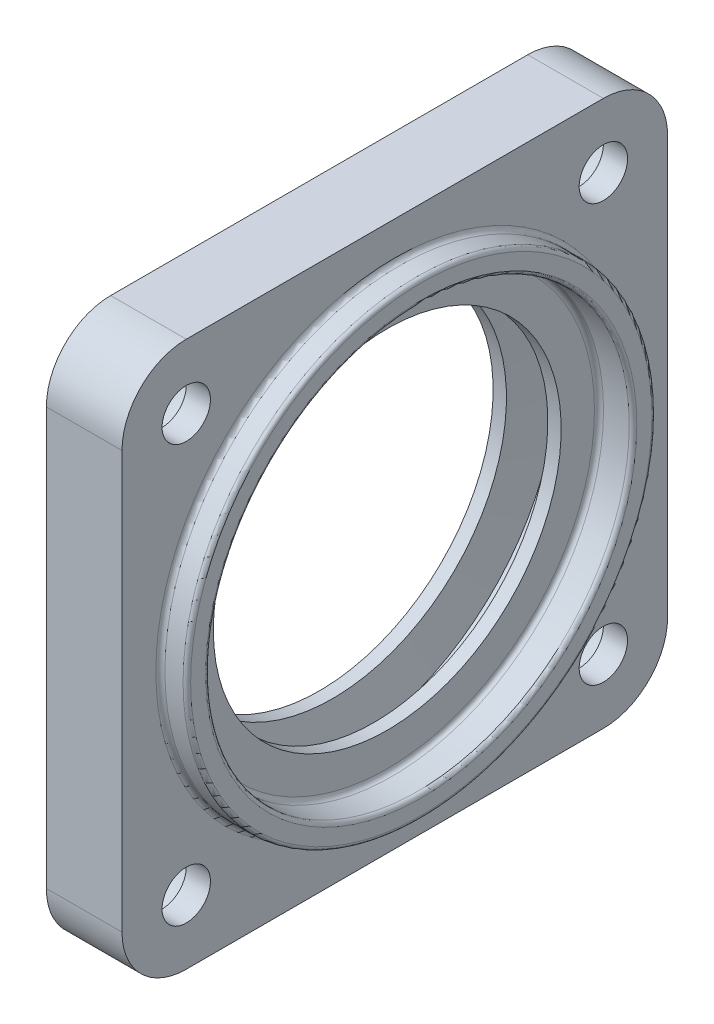
ISO-10303-21;
HEADER;
FILE_DESCRIPTION(('STEP AP214'),'2;1');
FILE_NAME('part.step','',(''),(''),'','','');
FILE_SCHEMA(('AUTOMOTIVE_DESIGN { 1 0 10303 214 1 1 1 1 }'));
ENDSEC;
DATA;
#1=APPLICATION_CONTEXT('core data for automotive mechanical design processes');
#2=APPLICATION_PROTOCOL_DEFINITION('international standard','automotive_design',2000,#1);
#3=PRODUCT_CONTEXT('',#1,'mechanical');
#4=PRODUCT('Part','Part','',(#3));
#5=PRODUCT_RELATED_PRODUCT_CATEGORY('part','',(#4));
#6=PRODUCT_DEFINITION_FORMATION('','',#4);
#7=PRODUCT_DEFINITION_CONTEXT('part definition',#1,'design');
#8=PRODUCT_DEFINITION('design','',#6,#7);
#9=PRODUCT_DEFINITION_SHAPE('','',#8);
#10=(LENGTH_UNIT() NAMED_UNIT(*) SI_UNIT(.MILLI.,.METRE.));
#11=(NAMED_UNIT(*) PLANE_ANGLE_UNIT() SI_UNIT($,.RADIAN.));
#12=(NAMED_UNIT(*) SI_UNIT($,.STERADIAN.) SOLID_ANGLE_UNIT());
#13=UNCERTAINTY_MEASURE_WITH_UNIT(LENGTH_MEASURE(1.E-05),#10,'distance_accuracy_value','');
#14=(GEOMETRIC_REPRESENTATION_CONTEXT(3) GLOBAL_UNCERTAINTY_ASSIGNED_CONTEXT((#13)) GLOBAL_UNIT_ASSIGNED_CONTEXT((#10,
#11,#12)) REPRESENTATION_CONTEXT('',''));
#15=CARTESIAN_POINT('',(0.,0.,0.));
#16=DIRECTION('',(0.,0.,1.));
#17=DIRECTION('',(1.,0.,0.));
#18=AXIS2_PLACEMENT_3D('',#15,#16,#17);
#19=CARTESIAN_POINT('',(0.,0.,0.));
#20=DIRECTION('',(-1.,0.,0.));
#21=DIRECTION('',(0.,0.,1.));
#22=AXIS2_PLACEMENT_3D('',#19,#20,#21);
#23=CYLINDRICAL_SURFACE('',#22,28.);
#24=CARTESIAN_POINT('',(5.09999999999999,0.,0.));
#25=DIRECTION('',(-1.,0.,0.));
#26=DIRECTION('',(0.,0.,1.));
#27=AXIS2_PLACEMENT_3D('',#24,#25,#26);
#28=CIRCLE('',#27,28.);
#29=CARTESIAN_POINT('',(5.09999999999999,0.,28.0000000000001));
#30=VERTEX_POINT('',#29);
#31=EDGE_CURVE('E41',#30,#30,#28,.T.);
#32=ORIENTED_EDGE('',*,*,#31,.T.);
#33=EDGE_LOOP('',(#32));
#34=FACE_BOUND('',#33,.T.);
#35=CARTESIAN_POINT('',(8.50000000000001,0.,0.));
#36=DIRECTION('',(1.,0.,0.));
#37=DIRECTION('',(0.,0.,-1.));
#38=AXIS2_PLACEMENT_3D('',#35,#36,#37);
#39=CIRCLE('',#38,28.);
#40=CARTESIAN_POINT('',(8.50000000000001,0.,-28.0000000000001));
#41=VERTEX_POINT('',#40);
#42=EDGE_CURVE('E239',#41,#41,#39,.T.);
#43=ORIENTED_EDGE('',*,*,#42,.T.);
#44=EDGE_LOOP('',(#43));
#45=FACE_BOUND('',#44,.T.);
#46=ADVANCED_FACE('F33',(#34,#45),#23,.F.);
#47=CARTESIAN_POINT('',(0.,0.,0.));
#48=DIRECTION('',(-1.,0.,0.));
#49=DIRECTION('',(0.,0.,1.));
#50=AXIS2_PLACEMENT_3D('',#47,#48,#49);
#51=CYLINDRICAL_SURFACE('',#50,31.);
#52=CARTESIAN_POINT('',(8.50000000000001,0.,0.));
#53=DIRECTION('',(1.,0.,0.));
#54=DIRECTION('',(0.,0.,-1.));
#55=AXIS2_PLACEMENT_3D('',#52,#53,#54);
#56=CIRCLE('',#55,31.);
#57=CARTESIAN_POINT('',(8.50000000000001,0.,-31.0000000000002));
#58=VERTEX_POINT('',#57);
#59=EDGE_CURVE('E242',#58,#58,#56,.F.);
#60=ORIENTED_EDGE('',*,*,#59,.T.);
#61=EDGE_LOOP('',(#60));
#62=FACE_BOUND('',#61,.T.);
#63=CARTESIAN_POINT('',(6.09999999999999,0.,0.));
#64=DIRECTION('',(-1.,0.,0.));
#65=DIRECTION('',(0.,0.,1.));
#66=AXIS2_PLACEMENT_3D('',#63,#64,#65);
#67=CIRCLE('',#66,31.);
#68=CARTESIAN_POINT('',(6.09999999999999,0.,31.0000000000002));
#69=VERTEX_POINT('',#68);
#70=EDGE_CURVE('E230',#69,#69,#67,.F.);
#71=ORIENTED_EDGE('',*,*,#70,.T.);
#72=EDGE_LOOP('',(#71));
#73=FACE_BOUND('',#72,.T.);
#74=ADVANCED_FACE('F259',(#62,#73),#51,.T.);
#75=CARTESIAN_POINT('',(-4.5,47.5000000000003,0.));
#76=DIRECTION('',(1.,0.,0.));
#77=DIRECTION('',(0.,0.,-1.));
#78=AXIS2_PLACEMENT_3D('',#75,#76,#77);
#79=PLANE('',#78);
#80=CARTESIAN_POINT('',(-4.5,27.5771644662755,-27.5771644662755));
#81=DIRECTION('',(-1.,0.,0.));
#82=DIRECTION('',(0.,0.,1.));
#83=AXIS2_PLACEMENT_3D('',#80,#81,#82);
#84=CIRCLE('',#83,5.49999999999999);
#85=CARTESIAN_POINT('',(-4.5,27.5771644662755,-22.0771644662755));
#86=VERTEX_POINT('',#85);
#87=EDGE_CURVE('E153',#86,#86,#84,.T.);
#88=ORIENTED_EDGE('',*,*,#87,.F.);
#89=EDGE_LOOP('',(#88));
#90=FACE_BOUND('',#89,.T.);
#91=CARTESIAN_POINT('',(-4.5,27.5771644662755,27.5771644662755));
#92=DIRECTION('',(-1.,0.,0.));
#93=DIRECTION('',(0.,0.,1.));
#94=AXIS2_PLACEMENT_3D('',#91,#92,#93);
#95=CIRCLE('',#94,5.49999999999999);
#96=CARTESIAN_POINT('',(-4.5,27.5771644662755,33.0771644662755));
#97=VERTEX_POINT('',#96);
#98=EDGE_CURVE('E163',#97,#97,#95,.T.);
#99=ORIENTED_EDGE('',*,*,#98,.F.);
#100=EDGE_LOOP('',(#99));
#101=FACE_BOUND('',#100,.T.);
#102=CARTESIAN_POINT('',(-4.5,-27.5771644662755,27.5771644662755));
#103=DIRECTION('',(-1.,0.,0.));
#104=DIRECTION('',(0.,0.,1.));
#105=AXIS2_PLACEMENT_3D('',#102,#103,#104);
#106=CIRCLE('',#105,5.49999999999999);
#107=CARTESIAN_POINT('',(-4.5,-27.5771644662755,33.0771644662755));
#108=VERTEX_POINT('',#107);
#109=EDGE_CURVE('E173',#108,#108,#106,.T.);
#110=ORIENTED_EDGE('',*,*,#109,.F.);
#111=EDGE_LOOP('',(#110));
#112=FACE_BOUND('',#111,.T.);
#113=CARTESIAN_POINT('',(-4.5,-27.5771644662755,-27.5771644662755));
#114=DIRECTION('',(-1.,0.,0.));
#115=DIRECTION('',(0.,0.,1.));
#116=AXIS2_PLACEMENT_3D('',#113,#114,#115);
#117=CIRCLE('',#116,5.49999999999999);
#118=CARTESIAN_POINT('',(-4.5,-27.5771644662755,-22.0771644662755));
#119=VERTEX_POINT('',#118);
#120=EDGE_CURVE('E183',#119,#119,#117,.T.);
#121=ORIENTED_EDGE('',*,*,#120,.F.);
#122=EDGE_LOOP('',(#121));
#123=FACE_BOUND('',#122,.T.);
#124=CARTESIAN_POINT('',(-4.5,0.,0.));
#125=DIRECTION('',(-1.,0.,0.));
#126=DIRECTION('',(0.,0.,1.));
#127=AXIS2_PLACEMENT_3D('',#124,#125,#126);
#128=CIRCLE('',#127,23.);
#129=CARTESIAN_POINT('',(-4.5,0.,23.0000000000001));
#130=VERTEX_POINT('',#129);
#131=EDGE_CURVE('E208',#130,#130,#128,.T.);
#132=ORIENTED_EDGE('',*,*,#131,.F.);
#133=EDGE_LOOP('',(#132));
#134=FACE_BOUND('',#133,.T.);
#135=CARTESIAN_POINT('',(-4.5,27.5771644662755,-27.5771644662755));
#136=DIRECTION('',(-1.,0.,0.));
#137=DIRECTION('',(0.,0.,1.));
#138=AXIS2_PLACEMENT_3D('',#135,#136,#137);
#139=CIRCLE('',#138,8.5);
#140=CARTESIAN_POINT('',(-4.5,36.0771644662755,-27.5771644662755));
#141=VERTEX_POINT('',#140);
#142=CARTESIAN_POINT('',(-4.5,27.5771644662757,-36.0771644662755));
#143=VERTEX_POINT('',#142);
#144=EDGE_CURVE('E414',#141,#143,#139,.T.);
#145=ORIENTED_EDGE('',*,*,#144,.T.);
#146=DIRECTION('',(0.,-1.,0.));
#147=VECTOR('',#146,1.);
#148=CARTESIAN_POINT('',(-4.5,27.5771644662757,-36.0771644662755));
#149=LINE('',#148,#147);
#150=CARTESIAN_POINT('',(-4.5,-27.5771644662755,-36.0771644662755));
#151=VERTEX_POINT('',#150);
#152=EDGE_CURVE('E105',#143,#151,#149,.T.);
#153=ORIENTED_EDGE('',*,*,#152,.T.);
#154=CARTESIAN_POINT('',(-4.5,-27.5771644662755,-27.5771644662755));
#155=DIRECTION('',(-1.,0.,0.));
#156=DIRECTION('',(0.,0.,1.));
#157=AXIS2_PLACEMENT_3D('',#154,#155,#156);
#158=CIRCLE('',#157,8.5);
#159=CARTESIAN_POINT('',(-4.5,-36.0771644662755,-27.5771644662755));
#160=VERTEX_POINT('',#159);
#161=EDGE_CURVE('E48',#151,#160,#158,.T.);
#162=ORIENTED_EDGE('',*,*,#161,.T.);
#163=DIRECTION('',(0.,0.,1.));
#164=VECTOR('',#163,1.);
#165=CARTESIAN_POINT('',(-4.5,-36.0771644662755,-27.5771644662755));
#166=LINE('',#165,#164);
#167=CARTESIAN_POINT('',(-4.5,-36.0771644662755,27.5771644662755));
#168=VERTEX_POINT('',#167);
#169=EDGE_CURVE('E103',#160,#168,#166,.T.);
#170=ORIENTED_EDGE('',*,*,#169,.T.);
#171=CARTESIAN_POINT('',(-4.5,-27.5771644662755,27.5771644662755));
#172=DIRECTION('',(-1.,0.,0.));
#173=DIRECTION('',(0.,0.,1.));
#174=AXIS2_PLACEMENT_3D('',#171,#172,#173);
#175=CIRCLE('',#174,8.5);
#176=CARTESIAN_POINT('',(-4.5,-27.5771644662755,36.0771644662755));
#177=VERTEX_POINT('',#176);
#178=EDGE_CURVE('E120',#168,#177,#175,.T.);
#179=ORIENTED_EDGE('',*,*,#178,.T.);
#180=DIRECTION('',(0.,1.,0.));
#181=VECTOR('',#180,1.);
#182=CARTESIAN_POINT('',(-4.5,-27.5771644662755,36.0771644662755));
#183=LINE('',#182,#181);
#184=CARTESIAN_POINT('',(-4.5,27.5771644662755,36.0771644662755));
#185=VERTEX_POINT('',#184);
#186=EDGE_CURVE('E122',#177,#185,#183,.T.);
#187=ORIENTED_EDGE('',*,*,#186,.T.);
#188=CARTESIAN_POINT('',(-4.5,27.5771644662755,27.5771644662755));
#189=DIRECTION('',(-1.,0.,0.));
#190=DIRECTION('',(0.,0.,1.));
#191=AXIS2_PLACEMENT_3D('',#188,#189,#190);
#192=CIRCLE('',#191,8.5);
#193=CARTESIAN_POINT('',(-4.5,36.0771644662755,27.5771644662755));
#194=VERTEX_POINT('',#193);
#195=EDGE_CURVE('E128',#185,#194,#192,.T.);
#196=ORIENTED_EDGE('',*,*,#195,.T.);
#197=DIRECTION('',(0.,0.,-1.));
#198=VECTOR('',#197,1.);
#199=CARTESIAN_POINT('',(-4.5,36.0771644662755,27.5771644662755));
#200=LINE('',#199,#198);
#201=EDGE_CURVE('E130',#194,#141,#200,.T.);
#202=ORIENTED_EDGE('',*,*,#201,.T.);
#203=EDGE_LOOP('',(#145,#153,#162,#170,#179,#187,#196,#202));
#204=FACE_BOUND('',#203,.T.);
#205=ADVANCED_FACE('F101',(#90,#101,#112,#123,#134,#204),#79,.F.);
#206=CARTESIAN_POINT('',(5.50000000000001,31.0000000000002,0.));
#207=DIRECTION('',(-1.,0.,0.));
#208=DIRECTION('',(0.,0.,1.));
#209=AXIS2_PLACEMENT_3D('',#206,#207,#208);
#210=PLANE('',#209);
#211=CARTESIAN_POINT('',(5.50000000000001,0.,0.));
#212=DIRECTION('',(-1.,0.,0.));
#213=DIRECTION('',(0.,0.,1.));
#214=AXIS2_PLACEMENT_3D('',#211,#212,#213);
#215=CIRCLE('',#214,31.6);
#216=CARTESIAN_POINT('',(5.50000000000001,0.,31.6000000000002));
#217=VERTEX_POINT('',#216);
#218=EDGE_CURVE('E227',#217,#217,#215,.T.);
#219=ORIENTED_EDGE('',*,*,#218,.T.);
#220=EDGE_LOOP('',(#219));
#221=FACE_BOUND('',#220,.T.);
#222=CARTESIAN_POINT('',(5.50000000000001,27.5771644662755,-27.5771644662755));
#223=DIRECTION('',(-1.,0.,0.));
#224=DIRECTION('',(0.,0.,1.));
#225=AXIS2_PLACEMENT_3D('',#222,#223,#224);
#226=CIRCLE('',#225,3.2);
#227=CARTESIAN_POINT('',(5.50000000000001,27.5771644662755,-24.3771644662755));
#228=VERTEX_POINT('',#227);
#229=EDGE_CURVE('E162',#228,#228,#226,.T.);
#230=ORIENTED_EDGE('',*,*,#229,.T.);
#231=EDGE_LOOP('',(#230));
#232=FACE_BOUND('',#231,.T.);
#233=CARTESIAN_POINT('',(5.50000000000001,27.5771644662755,27.5771644662755));
#234=DIRECTION('',(-1.,0.,0.));
#235=DIRECTION('',(0.,0.,1.));
#236=AXIS2_PLACEMENT_3D('',#233,#234,#235);
#237=CIRCLE('',#236,3.2);
#238=CARTESIAN_POINT('',(5.50000000000001,27.5771644662755,30.7771644662755));
#239=VERTEX_POINT('',#238);
#240=EDGE_CURVE('E172',#239,#239,#237,.T.);
#241=ORIENTED_EDGE('',*,*,#240,.T.);
#242=EDGE_LOOP('',(#241));
#243=FACE_BOUND('',#242,.T.);
#244=CARTESIAN_POINT('',(5.50000000000001,-27.5771644662755,27.5771644662755));
#245=DIRECTION('',(-1.,0.,0.));
#246=DIRECTION('',(0.,0.,1.));
#247=AXIS2_PLACEMENT_3D('',#244,#245,#246);
#248=CIRCLE('',#247,3.2);
#249=CARTESIAN_POINT('',(5.50000000000001,-27.5771644662755,30.7771644662755));
#250=VERTEX_POINT('',#249);
#251=EDGE_CURVE('E182',#250,#250,#248,.T.);
#252=ORIENTED_EDGE('',*,*,#251,.T.);
#253=EDGE_LOOP('',(#252));
#254=FACE_BOUND('',#253,.T.);
#255=CARTESIAN_POINT('',(5.50000000000001,-27.5771644662755,-27.5771644662755));
#256=DIRECTION('',(-1.,0.,0.));
#257=DIRECTION('',(0.,0.,1.));
#258=AXIS2_PLACEMENT_3D('',#255,#256,#257);
#259=CIRCLE('',#258,3.2);
#260=CARTESIAN_POINT('',(5.50000000000001,-27.5771644662755,-24.3771644662755));
#261=VERTEX_POINT('',#260);
#262=EDGE_CURVE('E192',#261,#261,#259,.T.);
#263=ORIENTED_EDGE('',*,*,#262,.T.);
#264=EDGE_LOOP('',(#263));
#265=FACE_BOUND('',#264,.T.);
#266=CARTESIAN_POINT('',(5.50000000000001,27.5771644662755,27.5771644662755));
#267=DIRECTION('',(-1.,0.,0.));
#268=DIRECTION('',(0.,0.,1.));
#269=AXIS2_PLACEMENT_3D('',#266,#267,#268);
#270=CIRCLE('',#269,8.5);
#271=CARTESIAN_POINT('',(5.50000000000001,27.5771644662755,36.0771644662755));
#272=VERTEX_POINT('',#271);
#273=CARTESIAN_POINT('',(5.50000000000001,36.0771644662755,27.5771644662755));
#274=VERTEX_POINT('',#273);
#275=EDGE_CURVE('E150',#272,#274,#270,.T.);
#276=ORIENTED_EDGE('',*,*,#275,.F.);
#277=DIRECTION('',(0.,1.,0.));
#278=VECTOR('',#277,1.);
#279=CARTESIAN_POINT('',(5.50000000000001,31.0000000000002,36.0771644662755));
#280=LINE('',#279,#278);
#281=CARTESIAN_POINT('',(5.50000000000001,-27.5771644662755,36.0771644662755));
#282=VERTEX_POINT('',#281);
#283=EDGE_CURVE('E225',#282,#272,#280,.T.);
#284=ORIENTED_EDGE('',*,*,#283,.F.);
#285=CARTESIAN_POINT('',(5.50000000000001,-27.5771644662755,27.5771644662755));
#286=DIRECTION('',(-1.,0.,0.));
#287=DIRECTION('',(0.,0.,1.));
#288=AXIS2_PLACEMENT_3D('',#285,#286,#287);
#289=CIRCLE('',#288,8.5);
#290=CARTESIAN_POINT('',(5.50000000000001,-36.0771644662755,27.5771644662755));
#291=VERTEX_POINT('',#290);
#292=EDGE_CURVE('E148',#291,#282,#289,.T.);
#293=ORIENTED_EDGE('',*,*,#292,.F.);
#294=DIRECTION('',(0.,0.,1.));
#295=VECTOR('',#294,1.);
#296=CARTESIAN_POINT('',(5.50000000000001,-36.0771644662755,0.));
#297=LINE('',#296,#295);
#298=CARTESIAN_POINT('',(5.50000000000001,-36.0771644662755,-27.5771644662755));
#299=VERTEX_POINT('',#298);
#300=EDGE_CURVE('E221',#299,#291,#297,.T.);
#301=ORIENTED_EDGE('',*,*,#300,.F.);
#302=CARTESIAN_POINT('',(5.50000000000001,-27.5771644662755,-27.5771644662755));
#303=DIRECTION('',(-1.,0.,0.));
#304=DIRECTION('',(0.,0.,1.));
#305=AXIS2_PLACEMENT_3D('',#302,#303,#304);
#306=CIRCLE('',#305,8.5);
#307=CARTESIAN_POINT('',(5.50000000000001,-27.5771644662755,-36.0771644662755));
#308=VERTEX_POINT('',#307);
#309=EDGE_CURVE('E111',#308,#299,#306,.T.);
#310=ORIENTED_EDGE('',*,*,#309,.F.);
#311=DIRECTION('',(0.,-1.,0.));
#312=VECTOR('',#311,1.);
#313=CARTESIAN_POINT('',(5.50000000000001,31.0000000000003,-36.0771644662755));
#314=LINE('',#313,#312);
#315=CARTESIAN_POINT('',(5.50000000000001,27.5771644662757,-36.0771644662755));
#316=VERTEX_POINT('',#315);
#317=EDGE_CURVE('E211',#316,#308,#314,.T.);
#318=ORIENTED_EDGE('',*,*,#317,.F.);
#319=CARTESIAN_POINT('',(5.50000000000001,27.5771644662755,-27.5771644662755));
#320=DIRECTION('',(-1.,0.,0.));
#321=DIRECTION('',(0.,0.,1.));
#322=AXIS2_PLACEMENT_3D('',#319,#320,#321);
#323=CIRCLE('',#322,8.5);
#324=CARTESIAN_POINT('',(5.50000000000001,36.0771644662755,-27.5771644662755));
#325=VERTEX_POINT('',#324);
#326=EDGE_CURVE('E56',#325,#316,#323,.T.);
#327=ORIENTED_EDGE('',*,*,#326,.F.);
#328=DIRECTION('',(0.,0.,-1.));
#329=VECTOR('',#328,1.);
#330=CARTESIAN_POINT('',(5.50000000000001,36.0771644662755,0.));
#331=LINE('',#330,#329);
#332=EDGE_CURVE('E223',#274,#325,#331,.T.);
#333=ORIENTED_EDGE('',*,*,#332,.F.);
#334=EDGE_LOOP('',(#276,#284,#293,#301,#310,#318,#327,#333));
#335=FACE_BOUND('',#334,.T.);
#336=ADVANCED_FACE('F292',(#221,#232,#243,#254,#265,#335),#210,.F.);
#337=CARTESIAN_POINT('',(0.,0.,0.));
#338=DIRECTION('',(-1.,0.,0.));
#339=DIRECTION('',(0.,0.,1.));
#340=AXIS2_PLACEMENT_3D('',#337,#338,#339);
#341=CYLINDRICAL_SURFACE('',#340,23.);
#342=CARTESIAN_POINT('',(-2.7367073654174,0.,0.));
#343=DIRECTION('',(-1.,0.,0.));
#344=DIRECTION('',(0.,0.,1.));
#345=AXIS2_PLACEMENT_3D('',#342,#343,#344);
#346=CIRCLE('',#345,23.);
#347=CARTESIAN_POINT('',(-2.7367073654174,0.,23.0000000000001));
#348=VERTEX_POINT('',#347);
#349=EDGE_CURVE('E205',#348,#348,#346,.T.);
#350=ORIENTED_EDGE('',*,*,#349,.F.);
#351=EDGE_LOOP('',(#350));
#352=FACE_BOUND('',#351,.T.);
#353=ORIENTED_EDGE('',*,*,#131,.T.);
#354=EDGE_LOOP('',(#353));
#355=FACE_BOUND('',#354,.T.);
#356=ADVANCED_FACE('F288',(#352,#355),#341,.F.);
#357=CARTESIAN_POINT('',(-2.7367073654174,0.,0.));
#358=DIRECTION('',(1.,0.,0.));
#359=DIRECTION('',(0.,0.,-1.));
#360=AXIS2_PLACEMENT_3D('',#357,#358,#359);
#361=CONICAL_SURFACE('',#360,23.,1.4486232791553);
#362=CARTESIAN_POINT('',(-2.,0.,0.));
#363=DIRECTION('',(-1.,0.,0.));
#364=DIRECTION('',(0.,0.,1.));
#365=AXIS2_PLACEMENT_3D('',#362,#363,#364);
#366=CIRCLE('',#365,29.);
#367=CARTESIAN_POINT('',(-2.,0.,29.0000000000001));
#368=VERTEX_POINT('',#367);
#369=EDGE_CURVE('E202',#368,#368,#366,.T.);
#370=ORIENTED_EDGE('',*,*,#369,.F.);
#371=EDGE_LOOP('',(#370));
#372=FACE_BOUND('',#371,.T.);
#373=ORIENTED_EDGE('',*,*,#349,.T.);
#374=EDGE_LOOP('',(#373));
#375=FACE_BOUND('',#374,.T.);
#376=ADVANCED_FACE('F284',(#372,#375),#361,.F.);
#377=CARTESIAN_POINT('',(0.,0.,0.));
#378=DIRECTION('',(-1.,0.,0.));
#379=DIRECTION('',(0.,0.,1.));
#380=AXIS2_PLACEMENT_3D('',#377,#378,#379);
#381=CYLINDRICAL_SURFACE('',#380,29.);
#382=CARTESIAN_POINT('',(2.,0.,0.));
#383=DIRECTION('',(-1.,0.,0.));
#384=DIRECTION('',(0.,0.,1.));
#385=AXIS2_PLACEMENT_3D('',#382,#383,#384);
#386=CIRCLE('',#385,29.);
#387=CARTESIAN_POINT('',(2.,0.,29.0000000000001));
#388=VERTEX_POINT('',#387);
#389=EDGE_CURVE('E199',#388,#388,#386,.T.);
#390=ORIENTED_EDGE('',*,*,#389,.F.);
#391=EDGE_LOOP('',(#390));
#392=FACE_BOUND('',#391,.T.);
#393=ORIENTED_EDGE('',*,*,#369,.T.);
#394=EDGE_LOOP('',(#393));
#395=FACE_BOUND('',#394,.T.);
#396=ADVANCED_FACE('F280',(#392,#395),#381,.F.);
#397=CARTESIAN_POINT('',(2.,0.,0.));
#398=DIRECTION('',(-1.,0.,0.));
#399=DIRECTION('',(0.,0.,1.));
#400=AXIS2_PLACEMENT_3D('',#397,#398,#399);
#401=CONICAL_SURFACE('',#400,29.,1.4486232791553);
#402=CARTESIAN_POINT('',(2.7367073654174,0.,0.));
#403=DIRECTION('',(-1.,0.,0.));
#404=DIRECTION('',(0.,0.,1.));
#405=AXIS2_PLACEMENT_3D('',#402,#403,#404);
#406=CIRCLE('',#405,23.);
#407=CARTESIAN_POINT('',(2.7367073654174,0.,23.0000000000001));
#408=VERTEX_POINT('',#407);
#409=EDGE_CURVE('E196',#408,#408,#406,.T.);
#410=ORIENTED_EDGE('',*,*,#409,.F.);
#411=EDGE_LOOP('',(#410));
#412=FACE_BOUND('',#411,.T.);
#413=ORIENTED_EDGE('',*,*,#389,.T.);
#414=EDGE_LOOP('',(#413));
#415=FACE_BOUND('',#414,.T.);
#416=ADVANCED_FACE('F276',(#412,#415),#401,.F.);
#417=CARTESIAN_POINT('',(0.,0.,0.));
#418=DIRECTION('',(-1.,0.,0.));
#419=DIRECTION('',(0.,0.,1.));
#420=AXIS2_PLACEMENT_3D('',#417,#418,#419);
#421=CYLINDRICAL_SURFACE('',#420,23.);
#422=CARTESIAN_POINT('',(4.5,0.,0.));
#423=DIRECTION('',(-1.,0.,0.));
#424=DIRECTION('',(0.,0.,1.));
#425=AXIS2_PLACEMENT_3D('',#422,#423,#424);
#426=CIRCLE('',#425,23.);
#427=CARTESIAN_POINT('',(4.5,0.,23.0000000000001));
#428=VERTEX_POINT('',#427);
#429=EDGE_CURVE('E193',#428,#428,#426,.T.);
#430=ORIENTED_EDGE('',*,*,#429,.F.);
#431=EDGE_LOOP('',(#430));
#432=FACE_BOUND('',#431,.T.);
#433=ORIENTED_EDGE('',*,*,#409,.T.);
#434=EDGE_LOOP('',(#433));
#435=FACE_BOUND('',#434,.T.);
#436=ADVANCED_FACE('F272',(#432,#435),#421,.F.);
#437=CARTESIAN_POINT('',(4.5,23.0000000000002,0.));
#438=DIRECTION('',(-1.,0.,0.));
#439=DIRECTION('',(0.,0.,1.));
#440=AXIS2_PLACEMENT_3D('',#437,#438,#439);
#441=PLANE('',#440);
#442=CARTESIAN_POINT('',(4.5,0.,0.));
#443=DIRECTION('',(-1.,0.,0.));
#444=DIRECTION('',(0.,0.,1.));
#445=AXIS2_PLACEMENT_3D('',#442,#443,#444);
#446=CIRCLE('',#445,27.4);
#447=CARTESIAN_POINT('',(4.5,0.,27.4000000000001));
#448=VERTEX_POINT('',#447);
#449=EDGE_CURVE('E12',#448,#448,#446,.F.);
#450=ORIENTED_EDGE('',*,*,#449,.T.);
#451=EDGE_LOOP('',(#450));
#452=FACE_BOUND('',#451,.T.);
#453=ORIENTED_EDGE('',*,*,#429,.T.);
#454=EDGE_LOOP('',(#453));
#455=FACE_BOUND('',#454,.T.);
#456=ADVANCED_FACE('F268',(#452,#455),#441,.F.);
#457=CARTESIAN_POINT('',(-4.5,-27.5771644662755,-27.5771644662755));
#458=DIRECTION('',(-1.,0.,0.));
#459=DIRECTION('',(0.,0.,1.));
#460=AXIS2_PLACEMENT_3D('',#457,#458,#459);
#461=CYLINDRICAL_SURFACE('',#460,3.2);
#462=CARTESIAN_POINT('',(2.3,-27.5771644662755,-27.5771644662755));
#463=DIRECTION('',(-1.,0.,0.));
#464=DIRECTION('',(0.,0.,1.));
#465=AXIS2_PLACEMENT_3D('',#462,#463,#464);
#466=CIRCLE('',#465,3.2);
#467=CARTESIAN_POINT('',(2.3,-27.5771644662755,-24.3771644662755));
#468=VERTEX_POINT('',#467);
#469=EDGE_CURVE('E189',#468,#468,#466,.T.);
#470=ORIENTED_EDGE('',*,*,#469,.T.);
#471=EDGE_LOOP('',(#470));
#472=FACE_BOUND('',#471,.T.);
#473=ORIENTED_EDGE('',*,*,#262,.F.);
#474=EDGE_LOOP('',(#473));
#475=FACE_BOUND('',#474,.T.);
#476=ADVANCED_FACE('F271',(#472,#475),#461,.F.);
#477=CARTESIAN_POINT('',(2.3,-24.3771644662755,-27.5771644662755));
#478=DIRECTION('',(1.,0.,0.));
#479=DIRECTION('',(0.,0.,-1.));
#480=AXIS2_PLACEMENT_3D('',#477,#478,#479);
#481=PLANE('',#480);
#482=ORIENTED_EDGE('',*,*,#469,.F.);
#483=EDGE_LOOP('',(#482));
#484=FACE_BOUND('',#483,.T.);
#485=CARTESIAN_POINT('',(2.3,-27.5771644662755,-27.5771644662755));
#486=DIRECTION('',(-1.,0.,0.));
#487=DIRECTION('',(0.,0.,1.));
#488=AXIS2_PLACEMENT_3D('',#485,#486,#487);
#489=CIRCLE('',#488,5.5);
#490=CARTESIAN_POINT('',(2.3,-27.5771644662755,-22.0771644662755));
#491=VERTEX_POINT('',#490);
#492=EDGE_CURVE('E186',#491,#491,#489,.T.);
#493=ORIENTED_EDGE('',*,*,#492,.T.);
#494=EDGE_LOOP('',(#493));
#495=FACE_BOUND('',#494,.T.);
#496=ADVANCED_FACE('F384',(#484,#495),#481,.F.);
#497=CARTESIAN_POINT('',(-4.5,-27.5771644662755,-27.5771644662755));
#498=DIRECTION('',(-1.,0.,0.));
#499=DIRECTION('',(0.,0.,1.));
#500=AXIS2_PLACEMENT_3D('',#497,#498,#499);
#501=CYLINDRICAL_SURFACE('',#500,5.5);
#502=ORIENTED_EDGE('',*,*,#492,.F.);
#503=EDGE_LOOP('',(#502));
#504=FACE_BOUND('',#503,.T.);
#505=ORIENTED_EDGE('',*,*,#120,.T.);
#506=EDGE_LOOP('',(#505));
#507=FACE_BOUND('',#506,.T.);
#508=ADVANCED_FACE('F380',(#504,#507),#501,.F.);
#509=CARTESIAN_POINT('',(-4.5,-27.5771644662755,27.5771644662755));
#510=DIRECTION('',(-1.,0.,0.));
#511=DIRECTION('',(0.,0.,1.));
#512=AXIS2_PLACEMENT_3D('',#509,#510,#511);
#513=CYLINDRICAL_SURFACE('',#512,3.2);
#514=CARTESIAN_POINT('',(2.3,-27.5771644662755,27.5771644662755));
#515=DIRECTION('',(-1.,0.,0.));
#516=DIRECTION('',(0.,0.,1.));
#517=AXIS2_PLACEMENT_3D('',#514,#515,#516);
#518=CIRCLE('',#517,3.2);
#519=CARTESIAN_POINT('',(2.3,-27.5771644662755,30.7771644662755));
#520=VERTEX_POINT('',#519);
#521=EDGE_CURVE('E179',#520,#520,#518,.T.);
#522=ORIENTED_EDGE('',*,*,#521,.T.);
#523=EDGE_LOOP('',(#522));
#524=FACE_BOUND('',#523,.T.);
#525=ORIENTED_EDGE('',*,*,#251,.F.);
#526=EDGE_LOOP('',(#525));
#527=FACE_BOUND('',#526,.T.);
#528=ADVANCED_FACE('F376',(#524,#527),#513,.F.);
#529=CARTESIAN_POINT('',(2.3,-24.3771644662755,27.5771644662755));
#530=DIRECTION('',(1.,0.,0.));
#531=DIRECTION('',(0.,0.,-1.));
#532=AXIS2_PLACEMENT_3D('',#529,#530,#531);
#533=PLANE('',#532);
#534=ORIENTED_EDGE('',*,*,#521,.F.);
#535=EDGE_LOOP('',(#534));
#536=FACE_BOUND('',#535,.T.);
#537=CARTESIAN_POINT('',(2.3,-27.5771644662755,27.5771644662755));
#538=DIRECTION('',(-1.,0.,0.));
#539=DIRECTION('',(0.,0.,1.));
#540=AXIS2_PLACEMENT_3D('',#537,#538,#539);
#541=CIRCLE('',#540,5.5);
#542=CARTESIAN_POINT('',(2.3,-27.5771644662755,33.0771644662755));
#543=VERTEX_POINT('',#542);
#544=EDGE_CURVE('E176',#543,#543,#541,.T.);
#545=ORIENTED_EDGE('',*,*,#544,.T.);
#546=EDGE_LOOP('',(#545));
#547=FACE_BOUND('',#546,.T.);
#548=ADVANCED_FACE('F372',(#536,#547),#533,.F.);
#549=CARTESIAN_POINT('',(-4.5,-27.5771644662755,27.5771644662755));
#550=DIRECTION('',(-1.,0.,0.));
#551=DIRECTION('',(0.,0.,1.));
#552=AXIS2_PLACEMENT_3D('',#549,#550,#551);
#553=CYLINDRICAL_SURFACE('',#552,5.5);
#554=ORIENTED_EDGE('',*,*,#544,.F.);
#555=EDGE_LOOP('',(#554));
#556=FACE_BOUND('',#555,.T.);
#557=ORIENTED_EDGE('',*,*,#109,.T.);
#558=EDGE_LOOP('',(#557));
#559=FACE_BOUND('',#558,.T.);
#560=ADVANCED_FACE('F368',(#556,#559),#553,.F.);
#561=CARTESIAN_POINT('',(-4.5,27.5771644662755,27.5771644662755));
#562=DIRECTION('',(-1.,0.,0.));
#563=DIRECTION('',(0.,0.,1.));
#564=AXIS2_PLACEMENT_3D('',#561,#562,#563);
#565=CYLINDRICAL_SURFACE('',#564,3.2);
#566=CARTESIAN_POINT('',(2.3,27.5771644662755,27.5771644662755));
#567=DIRECTION('',(-1.,0.,0.));
#568=DIRECTION('',(0.,0.,1.));
#569=AXIS2_PLACEMENT_3D('',#566,#567,#568);
#570=CIRCLE('',#569,3.2);
#571=CARTESIAN_POINT('',(2.3,27.5771644662755,30.7771644662755));
#572=VERTEX_POINT('',#571);
#573=EDGE_CURVE('E169',#572,#572,#570,.T.);
#574=ORIENTED_EDGE('',*,*,#573,.T.);
#575=EDGE_LOOP('',(#574));
#576=FACE_BOUND('',#575,.T.);
#577=ORIENTED_EDGE('',*,*,#240,.F.);
#578=EDGE_LOOP('',(#577));
#579=FACE_BOUND('',#578,.T.);
#580=ADVANCED_FACE('F364',(#576,#579),#565,.F.);
#581=CARTESIAN_POINT('',(2.3,30.7771644662755,27.5771644662755));
#582=DIRECTION('',(1.,0.,0.));
#583=DIRECTION('',(0.,0.,-1.));
#584=AXIS2_PLACEMENT_3D('',#581,#582,#583);
#585=PLANE('',#584);
#586=ORIENTED_EDGE('',*,*,#573,.F.);
#587=EDGE_LOOP('',(#586));
#588=FACE_BOUND('',#587,.T.);
#589=CARTESIAN_POINT('',(2.3,27.5771644662755,27.5771644662755));
#590=DIRECTION('',(-1.,0.,0.));
#591=DIRECTION('',(0.,0.,1.));
#592=AXIS2_PLACEMENT_3D('',#589,#590,#591);
#593=CIRCLE('',#592,5.5);
#594=CARTESIAN_POINT('',(2.3,27.5771644662755,33.0771644662756));
#595=VERTEX_POINT('',#594);
#596=EDGE_CURVE('E166',#595,#595,#593,.T.);
#597=ORIENTED_EDGE('',*,*,#596,.T.);
#598=EDGE_LOOP('',(#597));
#599=FACE_BOUND('',#598,.T.);
#600=ADVANCED_FACE('F360',(#588,#599),#585,.F.);
#601=CARTESIAN_POINT('',(-4.5,27.5771644662755,27.5771644662755));
#602=DIRECTION('',(-1.,0.,0.));
#603=DIRECTION('',(0.,0.,1.));
#604=AXIS2_PLACEMENT_3D('',#601,#602,#603);
#605=CYLINDRICAL_SURFACE('',#604,5.49999999999999);
#606=ORIENTED_EDGE('',*,*,#596,.F.);
#607=EDGE_LOOP('',(#606));
#608=FACE_BOUND('',#607,.T.);
#609=ORIENTED_EDGE('',*,*,#98,.T.);
#610=EDGE_LOOP('',(#609));
#611=FACE_BOUND('',#610,.T.);
#612=ADVANCED_FACE('F356',(#608,#611),#605,.F.);
#613=CARTESIAN_POINT('',(-4.5,27.5771644662755,-27.5771644662755));
#614=DIRECTION('',(-1.,0.,0.));
#615=DIRECTION('',(0.,0.,1.));
#616=AXIS2_PLACEMENT_3D('',#613,#614,#615);
#617=CYLINDRICAL_SURFACE('',#616,3.2);
#618=CARTESIAN_POINT('',(2.3,27.5771644662755,-27.5771644662755));
#619=DIRECTION('',(-1.,0.,0.));
#620=DIRECTION('',(0.,0.,1.));
#621=AXIS2_PLACEMENT_3D('',#618,#619,#620);
#622=CIRCLE('',#621,3.2);
#623=CARTESIAN_POINT('',(2.3,27.5771644662755,-24.3771644662755));
#624=VERTEX_POINT('',#623);
#625=EDGE_CURVE('E159',#624,#624,#622,.T.);
#626=ORIENTED_EDGE('',*,*,#625,.T.);
#627=EDGE_LOOP('',(#626));
#628=FACE_BOUND('',#627,.T.);
#629=ORIENTED_EDGE('',*,*,#229,.F.);
#630=EDGE_LOOP('',(#629));
#631=FACE_BOUND('',#630,.T.);
#632=ADVANCED_FACE('F352',(#628,#631),#617,.F.);
#633=CARTESIAN_POINT('',(2.3,30.7771644662755,-27.5771644662755));
#634=DIRECTION('',(1.,0.,0.));
#635=DIRECTION('',(0.,0.,-1.));
#636=AXIS2_PLACEMENT_3D('',#633,#634,#635);
#637=PLANE('',#636);
#638=ORIENTED_EDGE('',*,*,#625,.F.);
#639=EDGE_LOOP('',(#638));
#640=FACE_BOUND('',#639,.T.);
#641=CARTESIAN_POINT('',(2.3,27.5771644662755,-27.5771644662755));
#642=DIRECTION('',(-1.,0.,0.));
#643=DIRECTION('',(0.,0.,1.));
#644=AXIS2_PLACEMENT_3D('',#641,#642,#643);
#645=CIRCLE('',#644,5.5);
#646=CARTESIAN_POINT('',(2.3,27.5771644662755,-22.0771644662755));
#647=VERTEX_POINT('',#646);
#648=EDGE_CURVE('E156',#647,#647,#645,.T.);
#649=ORIENTED_EDGE('',*,*,#648,.T.);
#650=EDGE_LOOP('',(#649));
#651=FACE_BOUND('',#650,.T.);
#652=ADVANCED_FACE('F348',(#640,#651),#637,.F.);
#653=CARTESIAN_POINT('',(-4.5,27.5771644662755,-27.5771644662755));
#654=DIRECTION('',(-1.,0.,0.));
#655=DIRECTION('',(0.,0.,1.));
#656=AXIS2_PLACEMENT_3D('',#653,#654,#655);
#657=CYLINDRICAL_SURFACE('',#656,5.49999999999999);
#658=ORIENTED_EDGE('',*,*,#648,.F.);
#659=EDGE_LOOP('',(#658));
#660=FACE_BOUND('',#659,.T.);
#661=ORIENTED_EDGE('',*,*,#87,.T.);
#662=EDGE_LOOP('',(#661));
#663=FACE_BOUND('',#662,.T.);
#664=ADVANCED_FACE('F325',(#660,#663),#657,.F.);
#665=CARTESIAN_POINT('',(10.5,36.0771644662755,27.5771644662755));
#666=DIRECTION('',(0.,1.,0.));
#667=DIRECTION('',(0.,0.,1.));
#668=AXIS2_PLACEMENT_3D('',#665,#666,#667);
#669=PLANE('',#668);
#670=ORIENTED_EDGE('',*,*,#332,.T.);
#671=DIRECTION('',(-1.,0.,0.));
#672=VECTOR('',#671,1.);
#673=CARTESIAN_POINT('',(10.5,36.0771644662755,-27.5771644662755));
#674=LINE('',#673,#672);
#675=EDGE_CURVE('E134',#325,#141,#674,.T.);
#676=ORIENTED_EDGE('',*,*,#675,.T.);
#677=ORIENTED_EDGE('',*,*,#201,.F.);
#678=DIRECTION('',(-1.,0.,0.));
#679=VECTOR('',#678,1.);
#680=CARTESIAN_POINT('',(10.5,36.0771644662755,27.5771644662755));
#681=LINE('',#680,#679);
#682=EDGE_CURVE('E136',#274,#194,#681,.T.);
#683=ORIENTED_EDGE('',*,*,#682,.F.);
#684=EDGE_LOOP('',(#670,#676,#677,#683));
#685=FACE_BOUND('',#684,.T.);
#686=ADVANCED_FACE('F321',(#685),#669,.T.);
#687=CARTESIAN_POINT('',(10.5,-27.5771644662755,36.0771644662755));
#688=DIRECTION('',(0.,0.,1.));
#689=DIRECTION('',(1.,0.,0.));
#690=AXIS2_PLACEMENT_3D('',#687,#688,#689);
#691=PLANE('',#690);
#692=ORIENTED_EDGE('',*,*,#283,.T.);
#693=DIRECTION('',(-1.,0.,0.));
#694=VECTOR('',#693,1.);
#695=CARTESIAN_POINT('',(10.5,27.5771644662755,36.0771644662755));
#696=LINE('',#695,#694);
#697=EDGE_CURVE('E139',#272,#185,#696,.T.);
#698=ORIENTED_EDGE('',*,*,#697,.T.);
#699=ORIENTED_EDGE('',*,*,#186,.F.);
#700=DIRECTION('',(-1.,0.,0.));
#701=VECTOR('',#700,1.);
#702=CARTESIAN_POINT('',(10.5,-27.5771644662755,36.0771644662755));
#703=LINE('',#702,#701);
#704=EDGE_CURVE('E141',#282,#177,#703,.T.);
#705=ORIENTED_EDGE('',*,*,#704,.F.);
#706=EDGE_LOOP('',(#692,#698,#699,#705));
#707=FACE_BOUND('',#706,.T.);
#708=ADVANCED_FACE('F324',(#707),#691,.T.);
#709=CARTESIAN_POINT('',(10.5,-36.0771644662755,-27.5771644662755));
#710=DIRECTION('',(0.,-1.,0.));
#711=DIRECTION('',(0.,0.,-1.));
#712=AXIS2_PLACEMENT_3D('',#709,#710,#711);
#713=PLANE('',#712);
#714=ORIENTED_EDGE('',*,*,#300,.T.);
#715=DIRECTION('',(-1.,0.,0.));
#716=VECTOR('',#715,1.);
#717=CARTESIAN_POINT('',(10.5,-36.0771644662755,27.5771644662755));
#718=LINE('',#717,#716);
#719=EDGE_CURVE('E114',#291,#168,#718,.T.);
#720=ORIENTED_EDGE('',*,*,#719,.T.);
#721=ORIENTED_EDGE('',*,*,#169,.F.);
#722=DIRECTION('',(-1.,0.,0.));
#723=VECTOR('',#722,1.);
#724=CARTESIAN_POINT('',(10.5,-36.0771644662755,-27.5771644662755));
#725=LINE('',#724,#723);
#726=EDGE_CURVE('E108',#299,#160,#725,.T.);
#727=ORIENTED_EDGE('',*,*,#726,.F.);
#728=EDGE_LOOP('',(#714,#720,#721,#727));
#729=FACE_BOUND('',#728,.T.);
#730=ADVANCED_FACE('F117',(#729),#713,.T.);
#731=CARTESIAN_POINT('',(10.5,27.5771644662757,-36.0771644662755));
#732=DIRECTION('',(0.,0.,-1.));
#733=DIRECTION('',(-1.,0.,0.));
#734=AXIS2_PLACEMENT_3D('',#731,#732,#733);
#735=PLANE('',#734);
#736=ORIENTED_EDGE('',*,*,#317,.T.);
#737=DIRECTION('',(-1.,0.,0.));
#738=VECTOR('',#737,1.);
#739=CARTESIAN_POINT('',(10.5,-27.5771644662755,-36.0771644662755));
#740=LINE('',#739,#738);
#741=EDGE_CURVE('E115',#308,#151,#740,.T.);
#742=ORIENTED_EDGE('',*,*,#741,.T.);
#743=ORIENTED_EDGE('',*,*,#152,.F.);
#744=DIRECTION('',(-1.,0.,0.));
#745=VECTOR('',#744,1.);
#746=CARTESIAN_POINT('',(10.5,27.5771644662757,-36.0771644662755));
#747=LINE('',#746,#745);
#748=EDGE_CURVE('E133',#316,#143,#747,.T.);
#749=ORIENTED_EDGE('',*,*,#748,.F.);
#750=EDGE_LOOP('',(#736,#742,#743,#749));
#751=FACE_BOUND('',#750,.T.);
#752=ADVANCED_FACE('F339',(#751),#735,.T.);
#753=CARTESIAN_POINT('',(10.5,27.5771644662755,-27.5771644662755));
#754=DIRECTION('',(-1.,0.,0.));
#755=DIRECTION('',(0.,0.,1.));
#756=AXIS2_PLACEMENT_3D('',#753,#754,#755);
#757=CYLINDRICAL_SURFACE('',#756,8.5);
#758=ORIENTED_EDGE('',*,*,#326,.T.);
#759=ORIENTED_EDGE('',*,*,#748,.T.);
#760=ORIENTED_EDGE('',*,*,#144,.F.);
#761=ORIENTED_EDGE('',*,*,#675,.F.);
#762=EDGE_LOOP('',(#758,#759,#760,#761));
#763=FACE_BOUND('',#762,.T.);
#764=ADVANCED_FACE('F330',(#763),#757,.T.);
#765=CARTESIAN_POINT('',(10.5,27.5771644662755,27.5771644662755));
#766=DIRECTION('',(-1.,0.,0.));
#767=DIRECTION('',(0.,0.,1.));
#768=AXIS2_PLACEMENT_3D('',#765,#766,#767);
#769=CYLINDRICAL_SURFACE('',#768,8.5);
#770=ORIENTED_EDGE('',*,*,#275,.T.);
#771=ORIENTED_EDGE('',*,*,#682,.T.);
#772=ORIENTED_EDGE('',*,*,#195,.F.);
#773=ORIENTED_EDGE('',*,*,#697,.F.);
#774=EDGE_LOOP('',(#770,#771,#772,#773));
#775=FACE_BOUND('',#774,.T.);
#776=ADVANCED_FACE('F327',(#775),#769,.T.);
#777=CARTESIAN_POINT('',(10.5,-27.5771644662755,27.5771644662755));
#778=DIRECTION('',(-1.,0.,0.));
#779=DIRECTION('',(0.,0.,1.));
#780=AXIS2_PLACEMENT_3D('',#777,#778,#779);
#781=CYLINDRICAL_SURFACE('',#780,8.5);
#782=ORIENTED_EDGE('',*,*,#292,.T.);
#783=ORIENTED_EDGE('',*,*,#704,.T.);
#784=ORIENTED_EDGE('',*,*,#178,.F.);
#785=ORIENTED_EDGE('',*,*,#719,.F.);
#786=EDGE_LOOP('',(#782,#783,#784,#785));
#787=FACE_BOUND('',#786,.T.);
#788=ADVANCED_FACE('F318',(#787),#781,.T.);
#789=CARTESIAN_POINT('',(10.5,-27.5771644662755,-27.5771644662755));
#790=DIRECTION('',(-1.,0.,0.));
#791=DIRECTION('',(0.,0.,1.));
#792=AXIS2_PLACEMENT_3D('',#789,#790,#791);
#793=CYLINDRICAL_SURFACE('',#792,8.5);
#794=ORIENTED_EDGE('',*,*,#309,.T.);
#795=ORIENTED_EDGE('',*,*,#726,.T.);
#796=ORIENTED_EDGE('',*,*,#161,.F.);
#797=ORIENTED_EDGE('',*,*,#741,.F.);
#798=EDGE_LOOP('',(#794,#795,#796,#797));
#799=FACE_BOUND('',#798,.T.);
#800=ADVANCED_FACE('F109',(#799),#793,.T.);
#801=CARTESIAN_POINT('',(9.00000000000001,0.,0.));
#802=DIRECTION('',(1.,0.,0.));
#803=DIRECTION('',(0.,0.,-1.));
#804=AXIS2_PLACEMENT_3D('',#801,#802,#803);
#805=PLANE('',#804);
#806=CARTESIAN_POINT('',(9.00000000000001,0.,0.));
#807=DIRECTION('',(1.,0.,0.));
#808=DIRECTION('',(0.,0.,-1.));
#809=AXIS2_PLACEMENT_3D('',#806,#807,#808);
#810=CIRCLE('',#809,28.5);
#811=CARTESIAN_POINT('',(9.00000000000001,0.,-28.5000000000001));
#812=VERTEX_POINT('',#811);
#813=EDGE_CURVE('E236',#812,#812,#810,.F.);
#814=ORIENTED_EDGE('',*,*,#813,.T.);
#815=EDGE_LOOP('',(#814));
#816=FACE_BOUND('',#815,.T.);
#817=CARTESIAN_POINT('',(9.00000000000001,0.,0.));
#818=DIRECTION('',(1.,0.,0.));
#819=DIRECTION('',(0.,0.,-1.));
#820=AXIS2_PLACEMENT_3D('',#817,#818,#819);
#821=CIRCLE('',#820,30.5);
#822=CARTESIAN_POINT('',(9.00000000000001,0.,-30.5000000000002));
#823=VERTEX_POINT('',#822);
#824=EDGE_CURVE('E233',#823,#823,#821,.T.);
#825=ORIENTED_EDGE('',*,*,#824,.T.);
#826=EDGE_LOOP('',(#825));
#827=FACE_BOUND('',#826,.T.);
#828=ADVANCED_FACE('F300',(#816,#827),#805,.T.);
#829=CARTESIAN_POINT('',(6.09999999999999,0.,0.));
#830=DIRECTION('',(-1.,0.,0.));
#831=DIRECTION('',(0.,0.,1.));
#832=AXIS2_PLACEMENT_3D('',#829,#830,#831);
#833=TOROIDAL_SURFACE('',#832,31.6,0.6);
#834=ORIENTED_EDGE('',*,*,#70,.F.);
#835=EDGE_LOOP('',(#834));
#836=FACE_BOUND('',#835,.T.);
#837=ORIENTED_EDGE('',*,*,#218,.F.);
#838=EDGE_LOOP('',(#837));
#839=FACE_BOUND('',#838,.T.);
#840=ADVANCED_FACE('F297',(#836,#839),#833,.F.);
#841=CARTESIAN_POINT('',(8.50000000000001,0.,0.));
#842=DIRECTION('',(1.,0.,0.));
#843=DIRECTION('',(0.,0.,-1.));
#844=AXIS2_PLACEMENT_3D('',#841,#842,#843);
#845=TOROIDAL_SURFACE('',#844,28.5,0.5);
#846=ORIENTED_EDGE('',*,*,#42,.F.);
#847=EDGE_LOOP('',(#846));
#848=FACE_BOUND('',#847,.T.);
#849=ORIENTED_EDGE('',*,*,#813,.F.);
#850=EDGE_LOOP('',(#849));
#851=FACE_BOUND('',#850,.T.);
#852=ADVANCED_FACE('F255',(#848,#851),#845,.T.);
#853=CARTESIAN_POINT('',(8.50000000000001,0.,0.));
#854=DIRECTION('',(1.,0.,0.));
#855=DIRECTION('',(0.,0.,-1.));
#856=AXIS2_PLACEMENT_3D('',#853,#854,#855);
#857=TOROIDAL_SURFACE('',#856,30.5,0.5);
#858=ORIENTED_EDGE('',*,*,#59,.F.);
#859=EDGE_LOOP('',(#858));
#860=FACE_BOUND('',#859,.T.);
#861=ORIENTED_EDGE('',*,*,#824,.F.);
#862=EDGE_LOOP('',(#861));
#863=FACE_BOUND('',#862,.T.);
#864=ADVANCED_FACE('F250',(#860,#863),#857,.T.);
#865=CARTESIAN_POINT('',(5.09999999999999,0.,0.));
#866=DIRECTION('',(-1.,0.,0.));
#867=DIRECTION('',(0.,0.,1.));
#868=AXIS2_PLACEMENT_3D('',#865,#866,#867);
#869=TOROIDAL_SURFACE('',#868,27.4,0.6);
#870=ORIENTED_EDGE('',*,*,#449,.F.);
#871=EDGE_LOOP('',(#870));
#872=FACE_BOUND('',#871,.T.);
#873=ORIENTED_EDGE('',*,*,#31,.F.);
#874=EDGE_LOOP('',(#873));
#875=FACE_BOUND('',#874,.T.);
#876=ADVANCED_FACE('F35',(#872,#875),#869,.F.);
#877=CLOSED_SHELL('',(#46,#74,#205,#336,#356,#376,#396,#416,#436,#456,#476,#496,#508,#528,#548,
#560,#580,#600,#612,#632,#652,#664,#686,#708,#730,#752,#764,#776,#788,#800,#828,#840,#852,#864,#876));
#878=MANIFOLD_SOLID_BREP('B2',#877);
#879=ADVANCED_BREP_SHAPE_REPRESENTATION('',(#18,#878),#14);
#880=SHAPE_DEFINITION_REPRESENTATION(#9,#879);
ENDSEC;
END-ISO-10303-21;
